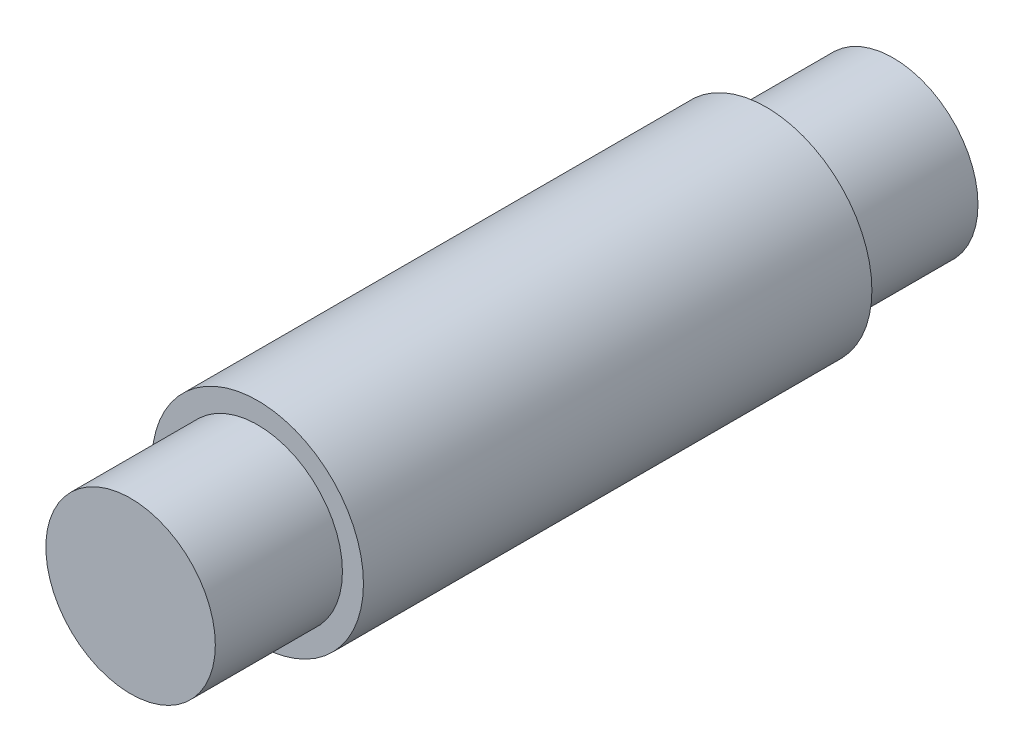
ISO-10303-21;
HEADER;
FILE_DESCRIPTION(('STEP AP214'),'2;1');
FILE_NAME('part.step','',(''),(''),'','','');
FILE_SCHEMA(('AUTOMOTIVE_DESIGN { 1 0 10303 214 1 1 1 1 }'));
ENDSEC;
DATA;
#1=APPLICATION_CONTEXT('core data for automotive mechanical design processes');
#2=APPLICATION_PROTOCOL_DEFINITION('international standard','automotive_design',2000,#1);
#3=PRODUCT_CONTEXT('',#1,'mechanical');
#4=PRODUCT('Part','Part','',(#3));
#5=PRODUCT_RELATED_PRODUCT_CATEGORY('part','',(#4));
#6=PRODUCT_DEFINITION_FORMATION('','',#4);
#7=PRODUCT_DEFINITION_CONTEXT('part definition',#1,'design');
#8=PRODUCT_DEFINITION('design','',#6,#7);
#9=PRODUCT_DEFINITION_SHAPE('','',#8);
#10=(LENGTH_UNIT() NAMED_UNIT(*) SI_UNIT(.MILLI.,.METRE.));
#11=(NAMED_UNIT(*) PLANE_ANGLE_UNIT() SI_UNIT($,.RADIAN.));
#12=(NAMED_UNIT(*) SI_UNIT($,.STERADIAN.) SOLID_ANGLE_UNIT());
#13=UNCERTAINTY_MEASURE_WITH_UNIT(LENGTH_MEASURE(1.E-05),#10,'distance_accuracy_value','');
#14=(GEOMETRIC_REPRESENTATION_CONTEXT(3) GLOBAL_UNCERTAINTY_ASSIGNED_CONTEXT((#13)) GLOBAL_UNIT_ASSIGNED_CONTEXT((#10,
#11,#12)) REPRESENTATION_CONTEXT('',''));
#15=CARTESIAN_POINT('',(0.,0.,0.));
#16=DIRECTION('',(0.,0.,1.));
#17=DIRECTION('',(1.,0.,0.));
#18=AXIS2_PLACEMENT_3D('',#15,#16,#17);
#19=CARTESIAN_POINT('',(0.,0.,9.525));
#20=DIRECTION('',(0.,0.,-1.));
#21=DIRECTION('',(-1.,0.,0.));
#22=AXIS2_PLACEMENT_3D('',#19,#20,#21);
#23=CYLINDRICAL_SURFACE('',#22,3.9624);
#24=CARTESIAN_POINT('',(0.,0.,9.525));
#25=DIRECTION('',(0.,0.,1.));
#26=DIRECTION('',(1.,0.,0.));
#27=AXIS2_PLACEMENT_3D('',#24,#25,#26);
#28=CIRCLE('',#27,3.9624);
#29=CARTESIAN_POINT('',(3.9624,0.,9.525));
#30=VERTEX_POINT('',#29);
#31=EDGE_CURVE('E40',#30,#30,#28,.T.);
#32=ORIENTED_EDGE('',*,*,#31,.F.);
#33=EDGE_LOOP('',(#32));
#34=FACE_BOUND('',#33,.T.);
#35=CARTESIAN_POINT('',(0.,0.,-9.525));
#36=DIRECTION('',(0.,0.,1.));
#37=DIRECTION('',(1.,0.,0.));
#38=AXIS2_PLACEMENT_3D('',#35,#36,#37);
#39=CIRCLE('',#38,3.9624);
#40=CARTESIAN_POINT('',(3.9624,0.,-9.525));
#41=VERTEX_POINT('',#40);
#42=EDGE_CURVE('E44',#41,#41,#39,.T.);
#43=ORIENTED_EDGE('',*,*,#42,.T.);
#44=EDGE_LOOP('',(#43));
#45=FACE_BOUND('',#44,.T.);
#46=ADVANCED_FACE('F34',(#34,#45),#23,.T.);
#47=CARTESIAN_POINT('',(0.,0.,9.525));
#48=DIRECTION('',(0.,0.,1.));
#49=DIRECTION('',(1.,0.,0.));
#50=AXIS2_PLACEMENT_3D('',#47,#48,#49);
#51=PLANE('',#50);
#52=CARTESIAN_POINT('',(0.,0.,9.525));
#53=DIRECTION('',(0.,0.,1.));
#54=DIRECTION('',(1.,0.,0.));
#55=AXIS2_PLACEMENT_3D('',#52,#53,#54);
#56=CIRCLE('',#55,3.175);
#57=CARTESIAN_POINT('',(3.175,0.,9.525));
#58=VERTEX_POINT('',#57);
#59=EDGE_CURVE('E49',#58,#58,#56,.F.);
#60=ORIENTED_EDGE('',*,*,#59,.T.);
#61=EDGE_LOOP('',(#60));
#62=FACE_BOUND('',#61,.T.);
#63=ORIENTED_EDGE('',*,*,#31,.T.);
#64=EDGE_LOOP('',(#63));
#65=FACE_BOUND('',#64,.T.);
#66=ADVANCED_FACE('F78',(#62,#65),#51,.T.);
#67=CARTESIAN_POINT('',(0.,0.,-9.525));
#68=DIRECTION('',(0.,0.,1.));
#69=DIRECTION('',(1.,0.,0.));
#70=AXIS2_PLACEMENT_3D('',#67,#68,#69);
#71=PLANE('',#70);
#72=CARTESIAN_POINT('',(0.,0.,-9.525));
#73=DIRECTION('',(0.,0.,1.));
#74=DIRECTION('',(1.,0.,0.));
#75=AXIS2_PLACEMENT_3D('',#72,#73,#74);
#76=CIRCLE('',#75,3.175);
#77=CARTESIAN_POINT('',(3.175,0.,-9.525));
#78=VERTEX_POINT('',#77);
#79=EDGE_CURVE('E10',#78,#78,#76,.F.);
#80=ORIENTED_EDGE('',*,*,#79,.F.);
#81=EDGE_LOOP('',(#80));
#82=FACE_BOUND('',#81,.T.);
#83=ORIENTED_EDGE('',*,*,#42,.F.);
#84=EDGE_LOOP('',(#83));
#85=FACE_BOUND('',#84,.T.);
#86=ADVANCED_FACE('F83',(#82,#85),#71,.F.);
#87=CARTESIAN_POINT('',(0.,0.,-14.2875));
#88=DIRECTION('',(0.,0.,1.));
#89=DIRECTION('',(1.,0.,0.));
#90=AXIS2_PLACEMENT_3D('',#87,#88,#89);
#91=PLANE('',#90);
#92=CARTESIAN_POINT('',(0.,0.,-14.2875));
#93=DIRECTION('',(0.,0.,1.));
#94=DIRECTION('',(1.,0.,0.));
#95=AXIS2_PLACEMENT_3D('',#92,#93,#94);
#96=CIRCLE('',#95,3.175);
#97=CARTESIAN_POINT('',(3.175,0.,-14.2875));
#98=VERTEX_POINT('',#97);
#99=EDGE_CURVE('E54',#98,#98,#96,.T.);
#100=ORIENTED_EDGE('',*,*,#99,.F.);
#101=EDGE_LOOP('',(#100));
#102=FACE_BOUND('',#101,.T.);
#103=ADVANCED_FACE('F72',(#102),#91,.F.);
#104=CARTESIAN_POINT('',(0.,0.,14.2875));
#105=DIRECTION('',(0.,0.,-1.));
#106=DIRECTION('',(-1.,0.,0.));
#107=AXIS2_PLACEMENT_3D('',#104,#105,#106);
#108=CYLINDRICAL_SURFACE('',#107,3.175);
#109=ORIENTED_EDGE('',*,*,#99,.T.);
#110=EDGE_LOOP('',(#109));
#111=FACE_BOUND('',#110,.T.);
#112=ORIENTED_EDGE('',*,*,#79,.T.);
#113=EDGE_LOOP('',(#112));
#114=FACE_BOUND('',#113,.T.);
#115=ADVANCED_FACE('F64',(#111,#114),#108,.T.);
#116=ORIENTED_EDGE('',*,*,#59,.F.);
#117=EDGE_LOOP('',(#116));
#118=FACE_BOUND('',#117,.T.);
#119=CARTESIAN_POINT('',(0.,0.,14.2875));
#120=DIRECTION('',(0.,0.,1.));
#121=DIRECTION('',(1.,0.,0.));
#122=AXIS2_PLACEMENT_3D('',#119,#120,#121);
#123=CIRCLE('',#122,3.175);
#124=CARTESIAN_POINT('',(3.175,0.,14.2875));
#125=VERTEX_POINT('',#124);
#126=EDGE_CURVE('E53',#125,#125,#123,.T.);
#127=ORIENTED_EDGE('',*,*,#126,.F.);
#128=EDGE_LOOP('',(#127));
#129=FACE_BOUND('',#128,.T.);
#130=ADVANCED_FACE('F62',(#118,#129),#108,.T.);
#131=CARTESIAN_POINT('',(0.,0.,14.2875));
#132=DIRECTION('',(0.,0.,1.));
#133=DIRECTION('',(1.,0.,0.));
#134=AXIS2_PLACEMENT_3D('',#131,#132,#133);
#135=PLANE('',#134);
#136=ORIENTED_EDGE('',*,*,#126,.T.);
#137=EDGE_LOOP('',(#136));
#138=FACE_BOUND('',#137,.T.);
#139=ADVANCED_FACE('F60',(#138),#135,.T.);
#140=CLOSED_SHELL('',(#46,#66,#86,#103,#115,#130,#139));
#141=MANIFOLD_SOLID_BREP('B2',#140);
#142=ADVANCED_BREP_SHAPE_REPRESENTATION('',(#18,#141),#14);
#143=SHAPE_DEFINITION_REPRESENTATION(#9,#142);
ENDSEC;
END-ISO-10303-21;
